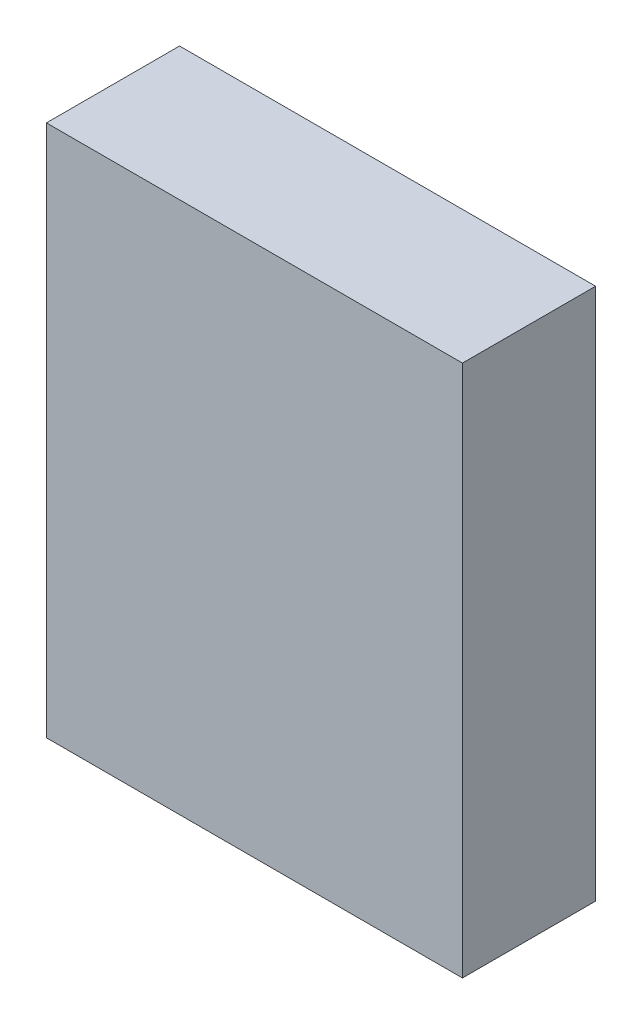
ISO-10303-21;
HEADER;
FILE_DESCRIPTION(('STEP AP214'),'2;1');
FILE_NAME('part.step','',(''),(''),'','','');
FILE_SCHEMA(('AUTOMOTIVE_DESIGN { 1 0 10303 214 1 1 1 1 }'));
ENDSEC;
DATA;
#1=APPLICATION_CONTEXT('core data for automotive mechanical design processes');
#2=APPLICATION_PROTOCOL_DEFINITION('international standard','automotive_design',2000,#1);
#3=PRODUCT_CONTEXT('',#1,'mechanical');
#4=PRODUCT('Part','Part','',(#3));
#5=PRODUCT_RELATED_PRODUCT_CATEGORY('part','',(#4));
#6=PRODUCT_DEFINITION_FORMATION('','',#4);
#7=PRODUCT_DEFINITION_CONTEXT('part definition',#1,'design');
#8=PRODUCT_DEFINITION('design','',#6,#7);
#9=PRODUCT_DEFINITION_SHAPE('','',#8);
#10=(LENGTH_UNIT() NAMED_UNIT(*) SI_UNIT(.MILLI.,.METRE.));
#11=(NAMED_UNIT(*) PLANE_ANGLE_UNIT() SI_UNIT($,.RADIAN.));
#12=(NAMED_UNIT(*) SI_UNIT($,.STERADIAN.) SOLID_ANGLE_UNIT());
#13=UNCERTAINTY_MEASURE_WITH_UNIT(LENGTH_MEASURE(1.E-05),#10,'distance_accuracy_value','');
#14=(GEOMETRIC_REPRESENTATION_CONTEXT(3) GLOBAL_UNCERTAINTY_ASSIGNED_CONTEXT((#13)) GLOBAL_UNIT_ASSIGNED_CONTEXT((#10,
#11,#12)) REPRESENTATION_CONTEXT('',''));
#15=CARTESIAN_POINT('',(0.,0.,0.));
#16=DIRECTION('',(0.,0.,1.));
#17=DIRECTION('',(1.,0.,0.));
#18=AXIS2_PLACEMENT_3D('',#15,#16,#17);
#19=CARTESIAN_POINT('',(1.25000004,-1.59999934,0.80000094));
#20=DIRECTION('',(0.,0.,-1.));
#21=DIRECTION('',(-1.,0.,0.));
#22=AXIS2_PLACEMENT_3D('',#19,#20,#21);
#23=PLANE('',#22);
#24=DIRECTION('',(1.,0.,0.));
#25=VECTOR('',#24,1.);
#26=CARTESIAN_POINT('',(1.25000004,1.59999934,0.80000094));
#27=LINE('',#26,#25);
#28=CARTESIAN_POINT('',(1.25000004,1.59999934,0.80000094));
#29=VERTEX_POINT('',#28);
#30=CARTESIAN_POINT('',(-1.25000004,1.59999934,0.80000094));
#31=VERTEX_POINT('',#30);
#32=EDGE_CURVE('E55',#29,#31,#27,.F.);
#33=ORIENTED_EDGE('',*,*,#32,.T.);
#34=DIRECTION('',(0.,1.,0.));
#35=VECTOR('',#34,1.);
#36=CARTESIAN_POINT('',(-1.25000004,1.59999934,0.80000094));
#37=LINE('',#36,#35);
#38=CARTESIAN_POINT('',(-1.25000004,-1.59999934,0.80000094));
#39=VERTEX_POINT('',#38);
#40=EDGE_CURVE('E57',#31,#39,#37,.F.);
#41=ORIENTED_EDGE('',*,*,#40,.T.);
#42=DIRECTION('',(1.,0.,0.));
#43=VECTOR('',#42,1.);
#44=CARTESIAN_POINT('',(-1.25000004,-1.59999934,0.80000094));
#45=LINE('',#44,#43);
#46=CARTESIAN_POINT('',(1.25000004,-1.59999934,0.80000094));
#47=VERTEX_POINT('',#46);
#48=EDGE_CURVE('E20',#39,#47,#45,.T.);
#49=ORIENTED_EDGE('',*,*,#48,.T.);
#50=DIRECTION('',(0.,1.,0.));
#51=VECTOR('',#50,1.);
#52=CARTESIAN_POINT('',(1.25000004,-1.59999934,0.80000094));
#53=LINE('',#52,#51);
#54=EDGE_CURVE('E80',#47,#29,#53,.T.);
#55=ORIENTED_EDGE('',*,*,#54,.T.);
#56=EDGE_LOOP('',(#33,#41,#49,#55));
#57=FACE_BOUND('',#56,.T.);
#58=ADVANCED_FACE('F17',(#57),#23,.F.);
#59=CARTESIAN_POINT('',(-1.25000004,-1.59999934,0.));
#60=DIRECTION('',(0.,1.,0.));
#61=DIRECTION('',(0.,0.,1.));
#62=AXIS2_PLACEMENT_3D('',#59,#60,#61);
#63=PLANE('',#62);
#64=DIRECTION('',(0.,0.,1.));
#65=VECTOR('',#64,1.);
#66=CARTESIAN_POINT('',(1.25000004,-1.59999934,0.));
#67=LINE('',#66,#65);
#68=CARTESIAN_POINT('',(1.25000004,-1.59999934,0.));
#69=VERTEX_POINT('',#68);
#70=EDGE_CURVE('E68',#69,#47,#67,.T.);
#71=ORIENTED_EDGE('',*,*,#70,.T.);
#72=ORIENTED_EDGE('',*,*,#48,.F.);
#73=DIRECTION('',(0.,0.,-1.));
#74=VECTOR('',#73,1.);
#75=CARTESIAN_POINT('',(-1.25000004,-1.59999934,0.));
#76=LINE('',#75,#74);
#77=CARTESIAN_POINT('',(-1.25000004,-1.59999934,0.));
#78=VERTEX_POINT('',#77);
#79=EDGE_CURVE('E63',#39,#78,#76,.T.);
#80=ORIENTED_EDGE('',*,*,#79,.T.);
#81=DIRECTION('',(-1.,0.,0.));
#82=VECTOR('',#81,1.);
#83=CARTESIAN_POINT('',(1.25000004,-1.59999934,0.));
#84=LINE('',#83,#82);
#85=EDGE_CURVE('E83',#69,#78,#84,.T.);
#86=ORIENTED_EDGE('',*,*,#85,.F.);
#87=EDGE_LOOP('',(#71,#72,#80,#86));
#88=FACE_BOUND('',#87,.T.);
#89=ADVANCED_FACE('F65',(#88),#63,.F.);
#90=CARTESIAN_POINT('',(-1.25000004,1.59999934,0.));
#91=DIRECTION('',(1.,0.,0.));
#92=DIRECTION('',(0.,0.,-1.));
#93=AXIS2_PLACEMENT_3D('',#90,#91,#92);
#94=PLANE('',#93);
#95=ORIENTED_EDGE('',*,*,#79,.F.);
#96=ORIENTED_EDGE('',*,*,#40,.F.);
#97=DIRECTION('',(0.,0.,-1.));
#98=VECTOR('',#97,1.);
#99=CARTESIAN_POINT('',(-1.25000004,1.59999934,0.));
#100=LINE('',#99,#98);
#101=CARTESIAN_POINT('',(-1.25000004,1.59999934,0.));
#102=VERTEX_POINT('',#101);
#103=EDGE_CURVE('E75',#31,#102,#100,.T.);
#104=ORIENTED_EDGE('',*,*,#103,.T.);
#105=DIRECTION('',(0.,1.,0.));
#106=VECTOR('',#105,1.);
#107=CARTESIAN_POINT('',(-1.25000004,-1.59999934,0.));
#108=LINE('',#107,#106);
#109=EDGE_CURVE('E72',#78,#102,#108,.T.);
#110=ORIENTED_EDGE('',*,*,#109,.F.);
#111=EDGE_LOOP('',(#95,#96,#104,#110));
#112=FACE_BOUND('',#111,.T.);
#113=ADVANCED_FACE('F70',(#112),#94,.F.);
#114=CARTESIAN_POINT('',(1.25000004,1.59999934,0.));
#115=DIRECTION('',(0.,-1.,0.));
#116=DIRECTION('',(0.,0.,-1.));
#117=AXIS2_PLACEMENT_3D('',#114,#115,#116);
#118=PLANE('',#117);
#119=ORIENTED_EDGE('',*,*,#103,.F.);
#120=ORIENTED_EDGE('',*,*,#32,.F.);
#121=DIRECTION('',(0.,0.,1.));
#122=VECTOR('',#121,1.);
#123=CARTESIAN_POINT('',(1.25000004,1.59999934,0.));
#124=LINE('',#123,#122);
#125=CARTESIAN_POINT('',(1.25000004,1.59999934,0.));
#126=VERTEX_POINT('',#125);
#127=EDGE_CURVE('E35',#29,#126,#124,.F.);
#128=ORIENTED_EDGE('',*,*,#127,.T.);
#129=DIRECTION('',(-1.,0.,0.));
#130=VECTOR('',#129,1.);
#131=CARTESIAN_POINT('',(1.25000004,1.59999934,0.));
#132=LINE('',#131,#130);
#133=EDGE_CURVE('E26',#102,#126,#132,.F.);
#134=ORIENTED_EDGE('',*,*,#133,.F.);
#135=EDGE_LOOP('',(#119,#120,#128,#134));
#136=FACE_BOUND('',#135,.T.);
#137=ADVANCED_FACE('F89',(#136),#118,.F.);
#138=CARTESIAN_POINT('',(1.25000004,-1.59999934,0.));
#139=DIRECTION('',(-1.,0.,0.));
#140=DIRECTION('',(0.,0.,1.));
#141=AXIS2_PLACEMENT_3D('',#138,#139,#140);
#142=PLANE('',#141);
#143=ORIENTED_EDGE('',*,*,#127,.F.);
#144=ORIENTED_EDGE('',*,*,#54,.F.);
#145=ORIENTED_EDGE('',*,*,#70,.F.);
#146=DIRECTION('',(0.,1.,0.));
#147=VECTOR('',#146,1.);
#148=CARTESIAN_POINT('',(1.25000004,-1.59999934,0.));
#149=LINE('',#148,#147);
#150=EDGE_CURVE('E11',#126,#69,#149,.F.);
#151=ORIENTED_EDGE('',*,*,#150,.F.);
#152=EDGE_LOOP('',(#143,#144,#145,#151));
#153=FACE_BOUND('',#152,.T.);
#154=ADVANCED_FACE('F91',(#153),#142,.F.);
#155=CARTESIAN_POINT('',(1.25000004,-1.59999934,0.));
#156=DIRECTION('',(0.,0.,-1.));
#157=DIRECTION('',(-1.,0.,0.));
#158=AXIS2_PLACEMENT_3D('',#155,#156,#157);
#159=PLANE('',#158);
#160=ORIENTED_EDGE('',*,*,#133,.T.);
#161=ORIENTED_EDGE('',*,*,#150,.T.);
#162=ORIENTED_EDGE('',*,*,#85,.T.);
#163=ORIENTED_EDGE('',*,*,#109,.T.);
#164=EDGE_LOOP('',(#160,#161,#162,#163));
#165=FACE_BOUND('',#164,.T.);
#166=ADVANCED_FACE('F88',(#165),#159,.T.);
#167=CLOSED_SHELL('',(#58,#89,#113,#137,#154,#166));
#168=MANIFOLD_SOLID_BREP('B1',#167);
#169=ADVANCED_BREP_SHAPE_REPRESENTATION('',(#18,#168),#14);
#170=SHAPE_DEFINITION_REPRESENTATION(#9,#169);
ENDSEC;
END-ISO-10303-21;
